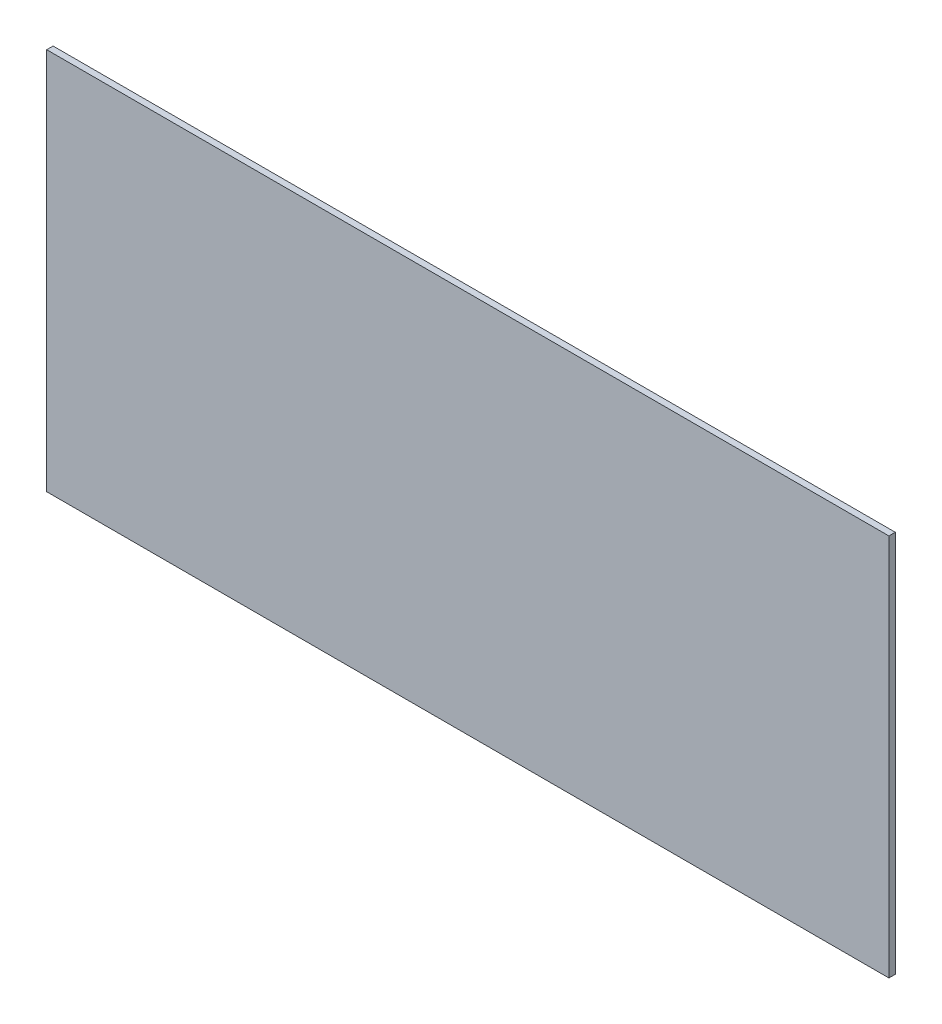
ISO-10303-21;
HEADER;
FILE_DESCRIPTION(('STEP AP214'),'2;1');
FILE_NAME('part.step','',(''),(''),'','','');
FILE_SCHEMA(('AUTOMOTIVE_DESIGN { 1 0 10303 214 1 1 1 1 }'));
ENDSEC;
DATA;
#1=APPLICATION_CONTEXT('core data for automotive mechanical design processes');
#2=APPLICATION_PROTOCOL_DEFINITION('international standard','automotive_design',2000,#1);
#3=PRODUCT_CONTEXT('',#1,'mechanical');
#4=PRODUCT('Part','Part','',(#3));
#5=PRODUCT_RELATED_PRODUCT_CATEGORY('part','',(#4));
#6=PRODUCT_DEFINITION_FORMATION('','',#4);
#7=PRODUCT_DEFINITION_CONTEXT('part definition',#1,'design');
#8=PRODUCT_DEFINITION('design','',#6,#7);
#9=PRODUCT_DEFINITION_SHAPE('','',#8);
#10=(LENGTH_UNIT() NAMED_UNIT(*) SI_UNIT(.MILLI.,.METRE.));
#11=(NAMED_UNIT(*) PLANE_ANGLE_UNIT() SI_UNIT($,.RADIAN.));
#12=(NAMED_UNIT(*) SI_UNIT($,.STERADIAN.) SOLID_ANGLE_UNIT());
#13=UNCERTAINTY_MEASURE_WITH_UNIT(LENGTH_MEASURE(1.E-05),#10,'distance_accuracy_value','');
#14=(GEOMETRIC_REPRESENTATION_CONTEXT(3) GLOBAL_UNCERTAINTY_ASSIGNED_CONTEXT((#13)) GLOBAL_UNIT_ASSIGNED_CONTEXT((#10,
#11,#12)) REPRESENTATION_CONTEXT('',''));
#15=CARTESIAN_POINT('',(0.,0.,0.));
#16=DIRECTION('',(0.,0.,1.));
#17=DIRECTION('',(1.,0.,0.));
#18=AXIS2_PLACEMENT_3D('',#15,#16,#17);
#19=CARTESIAN_POINT('',(-74.1234628329721,46.0211742752654,1.));
#20=DIRECTION('',(1.,0.,0.));
#21=DIRECTION('',(0.,1.,0.));
#22=AXIS2_PLACEMENT_3D('',#19,#20,#21);
#23=PLANE('',#22);
#24=DIRECTION('',(0.,-1.,0.));
#25=VECTOR('',#24,1.);
#26=CARTESIAN_POINT('',(-74.1234628329721,46.0211742752654,0.));
#27=LINE('',#26,#25);
#28=CARTESIAN_POINT('',(-74.1234628329721,46.0211742752654,0.));
#29=VERTEX_POINT('',#28);
#30=CARTESIAN_POINT('',(-74.1234628329721,-13.9788257247346,0.));
#31=VERTEX_POINT('',#30);
#32=EDGE_CURVE('E96',#29,#31,#27,.T.);
#33=ORIENTED_EDGE('',*,*,#32,.T.);
#34=DIRECTION('',(0.,0.,-1.));
#35=VECTOR('',#34,1.);
#36=CARTESIAN_POINT('',(-74.1234628329721,-13.9788257247346,1.));
#37=LINE('',#36,#35);
#38=CARTESIAN_POINT('',(-74.1234628329721,-13.9788257247346,1.));
#39=VERTEX_POINT('',#38);
#40=EDGE_CURVE('E11',#39,#31,#37,.T.);
#41=ORIENTED_EDGE('',*,*,#40,.F.);
#42=DIRECTION('',(0.,-1.,0.));
#43=VECTOR('',#42,1.);
#44=CARTESIAN_POINT('',(-74.1234628329721,46.0211742752654,1.));
#45=LINE('',#44,#43);
#46=CARTESIAN_POINT('',(-74.1234628329721,46.0211742752654,1.));
#47=VERTEX_POINT('',#46);
#48=EDGE_CURVE('E84',#47,#39,#45,.T.);
#49=ORIENTED_EDGE('',*,*,#48,.F.);
#50=DIRECTION('',(0.,0.,-1.));
#51=VECTOR('',#50,1.);
#52=CARTESIAN_POINT('',(-74.1234628329721,46.0211742752654,1.));
#53=LINE('',#52,#51);
#54=EDGE_CURVE('E92',#47,#29,#53,.T.);
#55=ORIENTED_EDGE('',*,*,#54,.T.);
#56=EDGE_LOOP('',(#33,#41,#49,#55));
#57=FACE_BOUND('',#56,.T.);
#58=ADVANCED_FACE('F33',(#57),#23,.F.);
#59=CARTESIAN_POINT('',(-74.1234628329721,-13.9788257247346,1.));
#60=DIRECTION('',(0.,1.,0.));
#61=DIRECTION('',(0.,0.,1.));
#62=AXIS2_PLACEMENT_3D('',#59,#60,#61);
#63=PLANE('',#62);
#64=DIRECTION('',(1.,0.,0.));
#65=VECTOR('',#64,1.);
#66=CARTESIAN_POINT('',(-74.1234628329721,-13.9788257247346,0.));
#67=LINE('',#66,#65);
#68=CARTESIAN_POINT('',(57.8765371670279,-13.9788257247346,0.));
#69=VERTEX_POINT('',#68);
#70=EDGE_CURVE('E88',#31,#69,#67,.T.);
#71=ORIENTED_EDGE('',*,*,#70,.T.);
#72=DIRECTION('',(0.,0.,-1.));
#73=VECTOR('',#72,1.);
#74=CARTESIAN_POINT('',(57.8765371670279,-13.9788257247346,1.));
#75=LINE('',#74,#73);
#76=CARTESIAN_POINT('',(57.8765371670279,-13.9788257247346,1.));
#77=VERTEX_POINT('',#76);
#78=EDGE_CURVE('E41',#77,#69,#75,.T.);
#79=ORIENTED_EDGE('',*,*,#78,.F.);
#80=DIRECTION('',(1.,0.,0.));
#81=VECTOR('',#80,1.);
#82=CARTESIAN_POINT('',(-74.1234628329721,-13.9788257247346,1.));
#83=LINE('',#82,#81);
#84=EDGE_CURVE('E79',#39,#77,#83,.T.);
#85=ORIENTED_EDGE('',*,*,#84,.F.);
#86=ORIENTED_EDGE('',*,*,#40,.T.);
#87=EDGE_LOOP('',(#71,#79,#85,#86));
#88=FACE_BOUND('',#87,.T.);
#89=ADVANCED_FACE('F87',(#88),#63,.F.);
#90=CARTESIAN_POINT('',(57.8765371670279,46.0211742752654,1.));
#91=DIRECTION('',(-1.,0.,0.));
#92=DIRECTION('',(0.,-1.,0.));
#93=AXIS2_PLACEMENT_3D('',#90,#91,#92);
#94=PLANE('',#93);
#95=DIRECTION('',(0.,1.,0.));
#96=VECTOR('',#95,1.);
#97=CARTESIAN_POINT('',(57.8765371670279,46.0211742752654,0.));
#98=LINE('',#97,#96);
#99=CARTESIAN_POINT('',(57.8765371670279,46.0211742752654,0.));
#100=VERTEX_POINT('',#99);
#101=EDGE_CURVE('E66',#69,#100,#98,.T.);
#102=ORIENTED_EDGE('',*,*,#101,.T.);
#103=DIRECTION('',(0.,0.,-1.));
#104=VECTOR('',#103,1.);
#105=CARTESIAN_POINT('',(57.8765371670279,46.0211742752654,1.));
#106=LINE('',#105,#104);
#107=CARTESIAN_POINT('',(57.8765371670279,46.0211742752654,1.));
#108=VERTEX_POINT('',#107);
#109=EDGE_CURVE('E89',#108,#100,#106,.T.);
#110=ORIENTED_EDGE('',*,*,#109,.F.);
#111=DIRECTION('',(0.,1.,0.));
#112=VECTOR('',#111,1.);
#113=CARTESIAN_POINT('',(57.8765371670279,46.0211742752654,1.));
#114=LINE('',#113,#112);
#115=EDGE_CURVE('E82',#77,#108,#114,.T.);
#116=ORIENTED_EDGE('',*,*,#115,.F.);
#117=ORIENTED_EDGE('',*,*,#78,.T.);
#118=EDGE_LOOP('',(#102,#110,#116,#117));
#119=FACE_BOUND('',#118,.T.);
#120=ADVANCED_FACE('F90',(#119),#94,.F.);
#121=CARTESIAN_POINT('',(-74.1234628329721,46.0211742752654,1.));
#122=DIRECTION('',(0.,-1.,0.));
#123=DIRECTION('',(0.,0.,-1.));
#124=AXIS2_PLACEMENT_3D('',#121,#122,#123);
#125=PLANE('',#124);
#126=DIRECTION('',(-1.,0.,0.));
#127=VECTOR('',#126,1.);
#128=CARTESIAN_POINT('',(-74.1234628329721,46.0211742752654,0.));
#129=LINE('',#128,#127);
#130=EDGE_CURVE('E72',#100,#29,#129,.T.);
#131=ORIENTED_EDGE('',*,*,#130,.T.);
#132=ORIENTED_EDGE('',*,*,#54,.F.);
#133=DIRECTION('',(-1.,0.,0.));
#134=VECTOR('',#133,1.);
#135=CARTESIAN_POINT('',(-74.1234628329721,46.0211742752654,1.));
#136=LINE('',#135,#134);
#137=EDGE_CURVE('E49',#108,#47,#136,.T.);
#138=ORIENTED_EDGE('',*,*,#137,.F.);
#139=ORIENTED_EDGE('',*,*,#109,.T.);
#140=EDGE_LOOP('',(#131,#132,#138,#139));
#141=FACE_BOUND('',#140,.T.);
#142=ADVANCED_FACE('F103',(#141),#125,.F.);
#143=CARTESIAN_POINT('',(-74.1234628329721,-13.9788257247346,1.));
#144=DIRECTION('',(0.,0.,1.));
#145=DIRECTION('',(1.,0.,0.));
#146=AXIS2_PLACEMENT_3D('',#143,#144,#145);
#147=PLANE('',#146);
#148=ORIENTED_EDGE('',*,*,#48,.T.);
#149=ORIENTED_EDGE('',*,*,#84,.T.);
#150=ORIENTED_EDGE('',*,*,#115,.T.);
#151=ORIENTED_EDGE('',*,*,#137,.T.);
#152=EDGE_LOOP('',(#148,#149,#150,#151));
#153=FACE_BOUND('',#152,.T.);
#154=ADVANCED_FACE('F80',(#153),#147,.T.);
#155=CARTESIAN_POINT('',(-74.1234628329721,-13.9788257247346,0.));
#156=DIRECTION('',(0.,0.,1.));
#157=DIRECTION('',(1.,0.,0.));
#158=AXIS2_PLACEMENT_3D('',#155,#156,#157);
#159=PLANE('',#158);
#160=ORIENTED_EDGE('',*,*,#32,.F.);
#161=ORIENTED_EDGE('',*,*,#130,.F.);
#162=ORIENTED_EDGE('',*,*,#101,.F.);
#163=ORIENTED_EDGE('',*,*,#70,.F.);
#164=EDGE_LOOP('',(#160,#161,#162,#163));
#165=FACE_BOUND('',#164,.T.);
#166=ADVANCED_FACE('F106',(#165),#159,.F.);
#167=CLOSED_SHELL('',(#58,#89,#120,#142,#154,#166));
#168=MANIFOLD_SOLID_BREP('B2',#167);
#169=ADVANCED_BREP_SHAPE_REPRESENTATION('',(#18,#168),#14);
#170=SHAPE_DEFINITION_REPRESENTATION(#9,#169);
ENDSEC;
END-ISO-10303-21;
